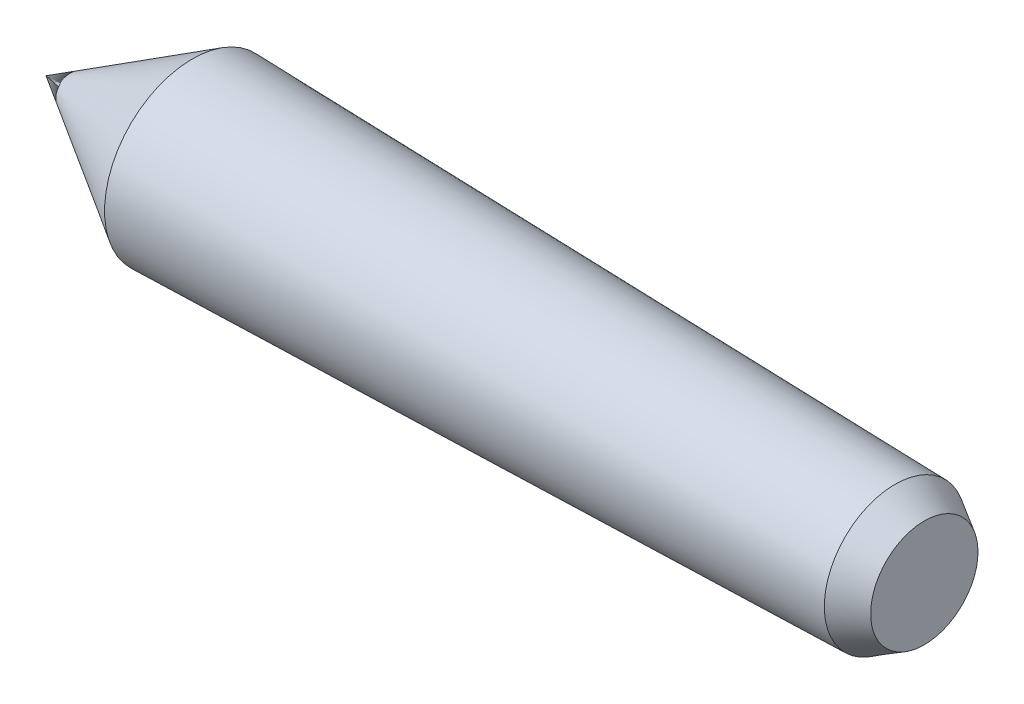
ISO-10303-21;
HEADER;
FILE_DESCRIPTION(('STEP AP214'),'2;1');
FILE_NAME('part.step','',(''),(''),'','','');
FILE_SCHEMA(('AUTOMOTIVE_DESIGN { 1 0 10303 214 1 1 1 1 }'));
ENDSEC;
DATA;
#1=APPLICATION_CONTEXT('core data for automotive mechanical design processes');
#2=APPLICATION_PROTOCOL_DEFINITION('international standard','automotive_design',2000,#1);
#3=PRODUCT_CONTEXT('',#1,'mechanical');
#4=PRODUCT('Part','Part','',(#3));
#5=PRODUCT_RELATED_PRODUCT_CATEGORY('part','',(#4));
#6=PRODUCT_DEFINITION_FORMATION('','',#4);
#7=PRODUCT_DEFINITION_CONTEXT('part definition',#1,'design');
#8=PRODUCT_DEFINITION('design','',#6,#7);
#9=PRODUCT_DEFINITION_SHAPE('','',#8);
#10=(LENGTH_UNIT() NAMED_UNIT(*) SI_UNIT(.MILLI.,.METRE.));
#11=(NAMED_UNIT(*) PLANE_ANGLE_UNIT() SI_UNIT($,.RADIAN.));
#12=(NAMED_UNIT(*) SI_UNIT($,.STERADIAN.) SOLID_ANGLE_UNIT());
#13=UNCERTAINTY_MEASURE_WITH_UNIT(LENGTH_MEASURE(1.E-05),#10,'distance_accuracy_value','');
#14=(GEOMETRIC_REPRESENTATION_CONTEXT(3) GLOBAL_UNCERTAINTY_ASSIGNED_CONTEXT((#13)) GLOBAL_UNIT_ASSIGNED_CONTEXT((#10,
#11,#12)) REPRESENTATION_CONTEXT('',''));
#15=CARTESIAN_POINT('',(0.,0.,0.));
#16=DIRECTION('',(0.,0.,1.));
#17=DIRECTION('',(1.,0.,0.));
#18=AXIS2_PLACEMENT_3D('',#15,#16,#17);
#19=CARTESIAN_POINT('',(90.,5.5,0.));
#20=DIRECTION('',(1.,0.,0.));
#21=DIRECTION('',(0.,0.,-1.));
#22=AXIS2_PLACEMENT_3D('',#19,#20,#21);
#23=PLANE('',#22);
#24=CARTESIAN_POINT('',(90.,0.,0.));
#25=DIRECTION('',(1.,0.,0.));
#26=DIRECTION('',(0.,0.,-1.));
#27=AXIS2_PLACEMENT_3D('',#24,#25,#26);
#28=CIRCLE('',#27,5.5);
#29=CARTESIAN_POINT('',(90.,0.,-5.5));
#30=VERTEX_POINT('',#29);
#31=EDGE_CURVE('E11',#30,#30,#28,.T.);
#32=ORIENTED_EDGE('',*,*,#31,.T.);
#33=EDGE_LOOP('',(#32));
#34=FACE_BOUND('',#33,.T.);
#35=ADVANCED_FACE('F32',(#34),#23,.T.);
#36=CARTESIAN_POINT('',(90.,0.,0.));
#37=DIRECTION('',(-1.,0.,0.));
#38=DIRECTION('',(0.,0.,1.));
#39=AXIS2_PLACEMENT_3D('',#36,#37,#38);
#40=CONICAL_SURFACE('',#39,5.5,0.528074448426359);
#41=CARTESIAN_POINT('',(87.,0.,0.));
#42=DIRECTION('',(1.,0.,0.));
#43=DIRECTION('',(0.,0.,-1.));
#44=AXIS2_PLACEMENT_3D('',#41,#42,#43);
#45=CIRCLE('',#44,7.25);
#46=CARTESIAN_POINT('',(87.,0.,-7.25));
#47=VERTEX_POINT('',#46);
#48=EDGE_CURVE('E38',#47,#47,#45,.T.);
#49=ORIENTED_EDGE('',*,*,#48,.T.);
#50=EDGE_LOOP('',(#49));
#51=FACE_BOUND('',#50,.T.);
#52=ORIENTED_EDGE('',*,*,#31,.F.);
#53=EDGE_LOOP('',(#52));
#54=FACE_BOUND('',#53,.T.);
#55=ADVANCED_FACE('F54',(#51,#54),#40,.T.);
#56=CARTESIAN_POINT('',(87.,0.,0.));
#57=DIRECTION('',(-1.,0.,0.));
#58=DIRECTION('',(0.,0.,1.));
#59=AXIS2_PLACEMENT_3D('',#56,#57,#58);
#60=CONICAL_SURFACE('',#59,7.25,0.0243007710011052);
#61=CARTESIAN_POINT('',(15.,0.,0.));
#62=DIRECTION('',(1.,0.,0.));
#63=DIRECTION('',(0.,0.,-1.));
#64=AXIS2_PLACEMENT_3D('',#61,#62,#63);
#65=CIRCLE('',#64,9.);
#66=CARTESIAN_POINT('',(15.,0.,-9.));
#67=VERTEX_POINT('',#66);
#68=EDGE_CURVE('E48',#67,#67,#65,.T.);
#69=ORIENTED_EDGE('',*,*,#68,.T.);
#70=EDGE_LOOP('',(#69));
#71=FACE_BOUND('',#70,.T.);
#72=ORIENTED_EDGE('',*,*,#48,.F.);
#73=EDGE_LOOP('',(#72));
#74=FACE_BOUND('',#73,.T.);
#75=ADVANCED_FACE('F44',(#71,#74),#60,.T.);
#76=CARTESIAN_POINT('',(15.,0.,0.));
#77=DIRECTION('',(1.,0.,0.));
#78=DIRECTION('',(0.,0.,-1.));
#79=AXIS2_PLACEMENT_3D('',#76,#77,#78);
#80=CONICAL_SURFACE('',#79,9.,0.540419500270584);
#81=CARTESIAN_POINT('',(0.,0.,0.));
#82=VERTEX_POINT('',#81);
#83=VERTEX_LOOP('',#82);
#84=FACE_BOUND('',#83,.T.);
#85=ORIENTED_EDGE('',*,*,#68,.F.);
#86=EDGE_LOOP('',(#85));
#87=FACE_BOUND('',#86,.T.);
#88=ADVANCED_FACE('F41',(#84,#87),#80,.T.);
#89=CLOSED_SHELL('',(#35,#55,#75,#88));
#90=MANIFOLD_SOLID_BREP('B2',#89);
#91=ADVANCED_BREP_SHAPE_REPRESENTATION('',(#18,#90),#14);
#92=SHAPE_DEFINITION_REPRESENTATION(#9,#91);
ENDSEC;
END-ISO-10303-21;
